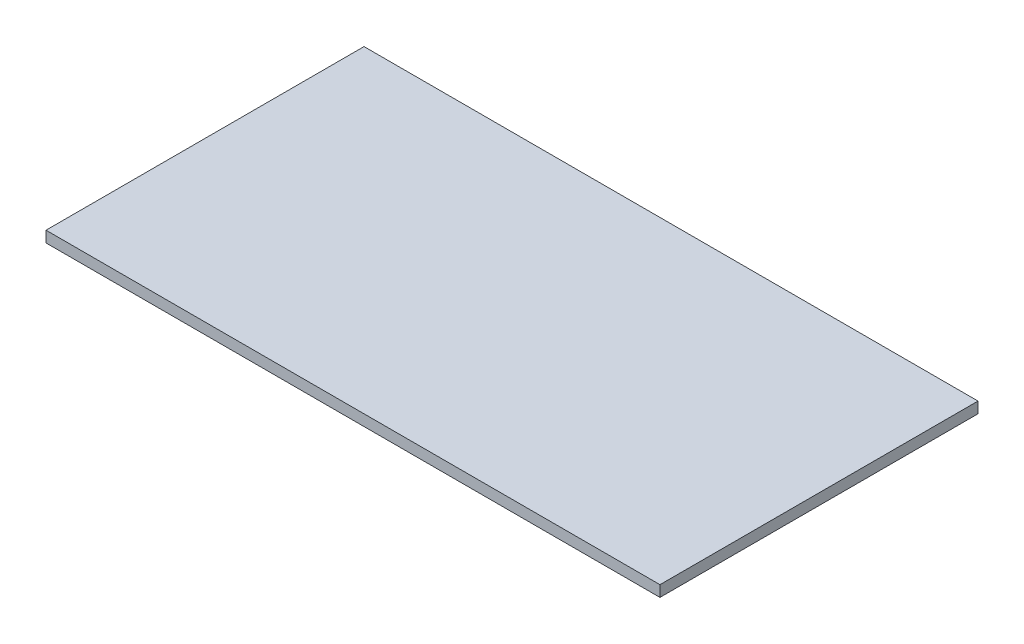
ISO-10303-21;
HEADER;
FILE_DESCRIPTION(('STEP AP214'),'2;1');
FILE_NAME('part.step','',(''),(''),'','','');
FILE_SCHEMA(('AUTOMOTIVE_DESIGN { 1 0 10303 214 1 1 1 1 }'));
ENDSEC;
DATA;
#1=APPLICATION_CONTEXT('core data for automotive mechanical design processes');
#2=APPLICATION_PROTOCOL_DEFINITION('international standard','automotive_design',2000,#1);
#3=PRODUCT_CONTEXT('',#1,'mechanical');
#4=PRODUCT('Part','Part','',(#3));
#5=PRODUCT_RELATED_PRODUCT_CATEGORY('part','',(#4));
#6=PRODUCT_DEFINITION_FORMATION('','',#4);
#7=PRODUCT_DEFINITION_CONTEXT('part definition',#1,'design');
#8=PRODUCT_DEFINITION('design','',#6,#7);
#9=PRODUCT_DEFINITION_SHAPE('','',#8);
#10=(LENGTH_UNIT() NAMED_UNIT(*) SI_UNIT(.MILLI.,.METRE.));
#11=(NAMED_UNIT(*) PLANE_ANGLE_UNIT() SI_UNIT($,.RADIAN.));
#12=(NAMED_UNIT(*) SI_UNIT($,.STERADIAN.) SOLID_ANGLE_UNIT());
#13=UNCERTAINTY_MEASURE_WITH_UNIT(LENGTH_MEASURE(1.E-05),#10,'distance_accuracy_value','');
#14=(GEOMETRIC_REPRESENTATION_CONTEXT(3) GLOBAL_UNCERTAINTY_ASSIGNED_CONTEXT((#13)) GLOBAL_UNIT_ASSIGNED_CONTEXT((#10,
#11,#12)) REPRESENTATION_CONTEXT('',''));
#15=CARTESIAN_POINT('',(0.,0.,0.));
#16=DIRECTION('',(0.,0.,1.));
#17=DIRECTION('',(1.,0.,0.));
#18=AXIS2_PLACEMENT_3D('',#15,#16,#17);
#19=CARTESIAN_POINT('',(0.,1.8,0.));
#20=DIRECTION('',(1.,0.,0.));
#21=DIRECTION('',(0.,0.,-1.));
#22=AXIS2_PLACEMENT_3D('',#19,#20,#21);
#23=PLANE('',#22);
#24=DIRECTION('',(0.,0.,1.));
#25=VECTOR('',#24,1.);
#26=CARTESIAN_POINT('',(0.,0.,0.));
#27=LINE('',#26,#25);
#28=CARTESIAN_POINT('',(0.,0.,-51.8));
#29=VERTEX_POINT('',#28);
#30=CARTESIAN_POINT('',(0.,0.,0.));
#31=VERTEX_POINT('',#30);
#32=EDGE_CURVE('E98',#29,#31,#27,.T.);
#33=ORIENTED_EDGE('',*,*,#32,.T.);
#34=DIRECTION('',(0.,-1.,0.));
#35=VECTOR('',#34,1.);
#36=CARTESIAN_POINT('',(0.,1.8,0.));
#37=LINE('',#36,#35);
#38=CARTESIAN_POINT('',(0.,1.8,0.));
#39=VERTEX_POINT('',#38);
#40=EDGE_CURVE('E11',#39,#31,#37,.T.);
#41=ORIENTED_EDGE('',*,*,#40,.F.);
#42=DIRECTION('',(0.,0.,1.));
#43=VECTOR('',#42,1.);
#44=CARTESIAN_POINT('',(0.,1.8,0.));
#45=LINE('',#44,#43);
#46=CARTESIAN_POINT('',(0.,1.8,-51.8));
#47=VERTEX_POINT('',#46);
#48=EDGE_CURVE('E86',#47,#39,#45,.T.);
#49=ORIENTED_EDGE('',*,*,#48,.F.);
#50=DIRECTION('',(0.,-1.,0.));
#51=VECTOR('',#50,1.);
#52=CARTESIAN_POINT('',(0.,1.8,-51.8));
#53=LINE('',#52,#51);
#54=EDGE_CURVE('E94',#47,#29,#53,.T.);
#55=ORIENTED_EDGE('',*,*,#54,.T.);
#56=EDGE_LOOP('',(#33,#41,#49,#55));
#57=FACE_BOUND('',#56,.T.);
#58=ADVANCED_FACE('F35',(#57),#23,.F.);
#59=CARTESIAN_POINT('',(0.,1.8,0.));
#60=DIRECTION('',(0.,0.,-1.));
#61=DIRECTION('',(-1.,0.,0.));
#62=AXIS2_PLACEMENT_3D('',#59,#60,#61);
#63=PLANE('',#62);
#64=DIRECTION('',(1.,0.,0.));
#65=VECTOR('',#64,1.);
#66=CARTESIAN_POINT('',(0.,0.,0.));
#67=LINE('',#66,#65);
#68=CARTESIAN_POINT('',(100.,0.,0.));
#69=VERTEX_POINT('',#68);
#70=EDGE_CURVE('E90',#31,#69,#67,.T.);
#71=ORIENTED_EDGE('',*,*,#70,.T.);
#72=DIRECTION('',(0.,-1.,0.));
#73=VECTOR('',#72,1.);
#74=CARTESIAN_POINT('',(100.,1.8,0.));
#75=LINE('',#74,#73);
#76=CARTESIAN_POINT('',(100.,1.8,0.));
#77=VERTEX_POINT('',#76);
#78=EDGE_CURVE('E43',#77,#69,#75,.T.);
#79=ORIENTED_EDGE('',*,*,#78,.F.);
#80=DIRECTION('',(1.,0.,0.));
#81=VECTOR('',#80,1.);
#82=CARTESIAN_POINT('',(0.,1.8,0.));
#83=LINE('',#82,#81);
#84=EDGE_CURVE('E81',#39,#77,#83,.T.);
#85=ORIENTED_EDGE('',*,*,#84,.F.);
#86=ORIENTED_EDGE('',*,*,#40,.T.);
#87=EDGE_LOOP('',(#71,#79,#85,#86));
#88=FACE_BOUND('',#87,.T.);
#89=ADVANCED_FACE('F89',(#88),#63,.F.);
#90=CARTESIAN_POINT('',(100.,1.8,0.));
#91=DIRECTION('',(-1.,0.,0.));
#92=DIRECTION('',(0.,0.,1.));
#93=AXIS2_PLACEMENT_3D('',#90,#91,#92);
#94=PLANE('',#93);
#95=DIRECTION('',(0.,0.,-1.));
#96=VECTOR('',#95,1.);
#97=CARTESIAN_POINT('',(100.,0.,0.));
#98=LINE('',#97,#96);
#99=CARTESIAN_POINT('',(100.,0.,-51.8));
#100=VERTEX_POINT('',#99);
#101=EDGE_CURVE('E68',#69,#100,#98,.T.);
#102=ORIENTED_EDGE('',*,*,#101,.T.);
#103=DIRECTION('',(0.,-1.,0.));
#104=VECTOR('',#103,1.);
#105=CARTESIAN_POINT('',(100.,1.8,-51.8));
#106=LINE('',#105,#104);
#107=CARTESIAN_POINT('',(100.,1.8,-51.8));
#108=VERTEX_POINT('',#107);
#109=EDGE_CURVE('E91',#108,#100,#106,.T.);
#110=ORIENTED_EDGE('',*,*,#109,.F.);
#111=DIRECTION('',(0.,0.,-1.));
#112=VECTOR('',#111,1.);
#113=CARTESIAN_POINT('',(100.,1.8,0.));
#114=LINE('',#113,#112);
#115=EDGE_CURVE('E84',#77,#108,#114,.T.);
#116=ORIENTED_EDGE('',*,*,#115,.F.);
#117=ORIENTED_EDGE('',*,*,#78,.T.);
#118=EDGE_LOOP('',(#102,#110,#116,#117));
#119=FACE_BOUND('',#118,.T.);
#120=ADVANCED_FACE('F92',(#119),#94,.F.);
#121=CARTESIAN_POINT('',(0.,1.8,-51.8));
#122=DIRECTION('',(0.,0.,1.));
#123=DIRECTION('',(1.,0.,0.));
#124=AXIS2_PLACEMENT_3D('',#121,#122,#123);
#125=PLANE('',#124);
#126=DIRECTION('',(-1.,0.,0.));
#127=VECTOR('',#126,1.);
#128=CARTESIAN_POINT('',(0.,0.,-51.8));
#129=LINE('',#128,#127);
#130=EDGE_CURVE('E74',#100,#29,#129,.T.);
#131=ORIENTED_EDGE('',*,*,#130,.T.);
#132=ORIENTED_EDGE('',*,*,#54,.F.);
#133=DIRECTION('',(-1.,0.,0.));
#134=VECTOR('',#133,1.);
#135=CARTESIAN_POINT('',(0.,1.8,-51.8));
#136=LINE('',#135,#134);
#137=EDGE_CURVE('E51',#108,#47,#136,.T.);
#138=ORIENTED_EDGE('',*,*,#137,.F.);
#139=ORIENTED_EDGE('',*,*,#109,.T.);
#140=EDGE_LOOP('',(#131,#132,#138,#139));
#141=FACE_BOUND('',#140,.T.);
#142=ADVANCED_FACE('F105',(#141),#125,.F.);
#143=CARTESIAN_POINT('',(0.,1.8,0.));
#144=DIRECTION('',(0.,-1.,0.));
#145=DIRECTION('',(0.,0.,-1.));
#146=AXIS2_PLACEMENT_3D('',#143,#144,#145);
#147=PLANE('',#146);
#148=ORIENTED_EDGE('',*,*,#48,.T.);
#149=ORIENTED_EDGE('',*,*,#84,.T.);
#150=ORIENTED_EDGE('',*,*,#115,.T.);
#151=ORIENTED_EDGE('',*,*,#137,.T.);
#152=EDGE_LOOP('',(#148,#149,#150,#151));
#153=FACE_BOUND('',#152,.T.);
#154=ADVANCED_FACE('F82',(#153),#147,.F.);
#155=CARTESIAN_POINT('',(0.,0.,0.));
#156=DIRECTION('',(0.,-1.,0.));
#157=DIRECTION('',(0.,0.,-1.));
#158=AXIS2_PLACEMENT_3D('',#155,#156,#157);
#159=PLANE('',#158);
#160=ORIENTED_EDGE('',*,*,#32,.F.);
#161=ORIENTED_EDGE('',*,*,#130,.F.);
#162=ORIENTED_EDGE('',*,*,#101,.F.);
#163=ORIENTED_EDGE('',*,*,#70,.F.);
#164=EDGE_LOOP('',(#160,#161,#162,#163));
#165=FACE_BOUND('',#164,.T.);
#166=ADVANCED_FACE('F108',(#165),#159,.T.);
#167=CLOSED_SHELL('',(#58,#89,#120,#142,#154,#166));
#168=MANIFOLD_SOLID_BREP('B2',#167);
#169=ADVANCED_BREP_SHAPE_REPRESENTATION('',(#18,#168),#14);
#170=SHAPE_DEFINITION_REPRESENTATION(#9,#169);
ENDSEC;
END-ISO-10303-21;
